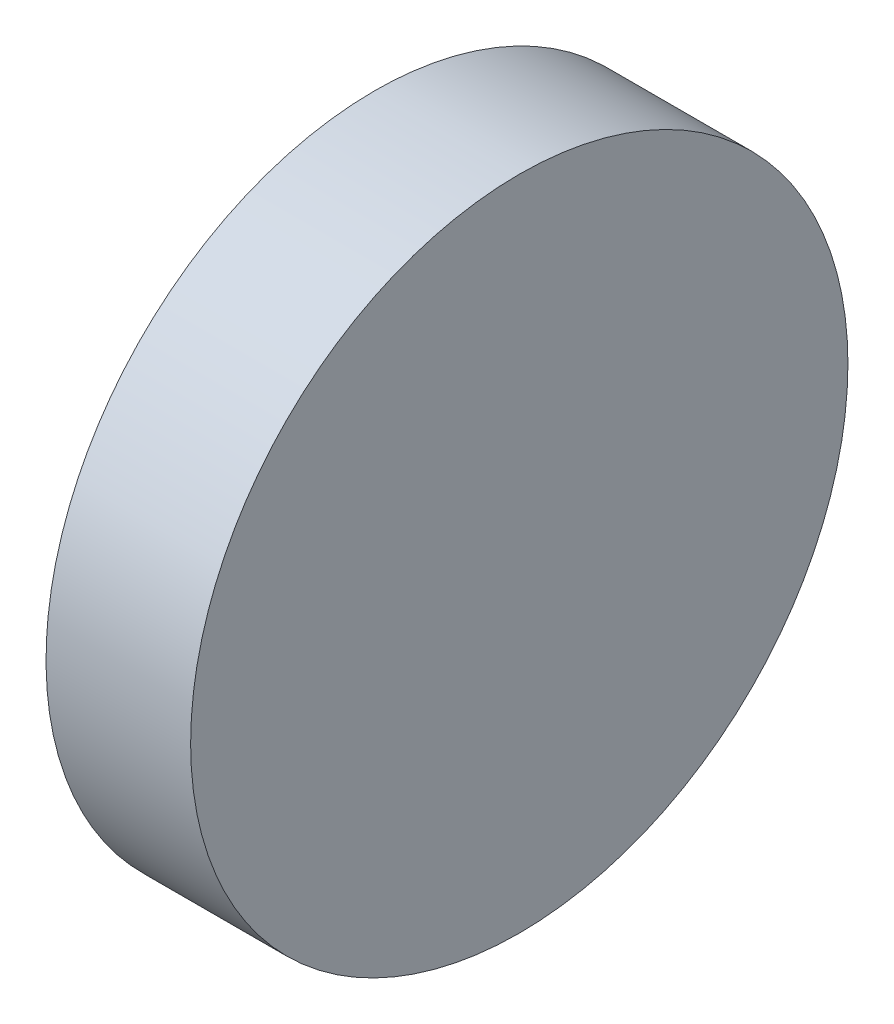
ISO-10303-21;
HEADER;
FILE_DESCRIPTION(('STEP AP214'),'2;1');
FILE_NAME('part.step','',(''),(''),'','','');
FILE_SCHEMA(('AUTOMOTIVE_DESIGN { 1 0 10303 214 1 1 1 1 }'));
ENDSEC;
DATA;
#1=APPLICATION_CONTEXT('core data for automotive mechanical design processes');
#2=APPLICATION_PROTOCOL_DEFINITION('international standard','automotive_design',2000,#1);
#3=PRODUCT_CONTEXT('',#1,'mechanical');
#4=PRODUCT('Part','Part','',(#3));
#5=PRODUCT_RELATED_PRODUCT_CATEGORY('part','',(#4));
#6=PRODUCT_DEFINITION_FORMATION('','',#4);
#7=PRODUCT_DEFINITION_CONTEXT('part definition',#1,'design');
#8=PRODUCT_DEFINITION('design','',#6,#7);
#9=PRODUCT_DEFINITION_SHAPE('','',#8);
#10=(LENGTH_UNIT() NAMED_UNIT(*) SI_UNIT(.MILLI.,.METRE.));
#11=(NAMED_UNIT(*) PLANE_ANGLE_UNIT() SI_UNIT($,.RADIAN.));
#12=(NAMED_UNIT(*) SI_UNIT($,.STERADIAN.) SOLID_ANGLE_UNIT());
#13=UNCERTAINTY_MEASURE_WITH_UNIT(LENGTH_MEASURE(1.E-05),#10,'distance_accuracy_value','');
#14=(GEOMETRIC_REPRESENTATION_CONTEXT(3) GLOBAL_UNCERTAINTY_ASSIGNED_CONTEXT((#13)) GLOBAL_UNIT_ASSIGNED_CONTEXT((#10,
#11,#12)) REPRESENTATION_CONTEXT('',''));
#15=CARTESIAN_POINT('',(0.,0.,0.));
#16=DIRECTION('',(0.,0.,1.));
#17=DIRECTION('',(1.,0.,0.));
#18=AXIS2_PLACEMENT_3D('',#15,#16,#17);
#19=CARTESIAN_POINT('',(171.379588267492,8.22627416998075,100.));
#20=CARTESIAN_POINT('',(171.379588267492,8.22627416998075,100.53840391905));
#21=CARTESIAN_POINT('',(171.379588267492,8.12021785486038,101.615211757149));
#22=CARTESIAN_POINT('',(171.379588267492,7.64907796388822,103.168351832291));
#23=CARTESIAN_POINT('',(171.379588267492,6.88398829641619,104.599733923351));
#24=CARTESIAN_POINT('',(171.379588267492,5.85435081929807,105.854350819297));
#25=CARTESIAN_POINT('',(171.379588267492,4.59973392335213,106.883988296415));
#26=CARTESIAN_POINT('',(171.379588267492,3.16835183229228,107.649077963887));
#27=CARTESIAN_POINT('',(171.379588267492,1.61521175714969,108.120217854859));
#28=CARTESIAN_POINT('',(171.379588267492,1.04746292572663E-12,108.27930232754));
#29=CARTESIAN_POINT('',(171.379588267492,-1.61521175714759,108.120217854859));
#30=CARTESIAN_POINT('',(171.379588267492,-3.16835183229019,107.649077963887));
#31=CARTESIAN_POINT('',(171.379588267492,-4.59973392335003,106.883988296415));
#32=CARTESIAN_POINT('',(171.379588267492,-5.85435081929598,105.854350819297));
#33=CARTESIAN_POINT('',(171.379588267492,-6.88398829641409,104.599733923351));
#34=CARTESIAN_POINT('',(171.379588267492,-7.64907796388613,103.168351832291));
#35=CARTESIAN_POINT('',(171.379588267492,-8.12021785485828,101.615211757149));
#36=CARTESIAN_POINT('',(171.379588267492,-8.27930232753885,100.));
#37=CARTESIAN_POINT('',(171.379588267492,-8.12021785485828,98.3847882428514));
#38=CARTESIAN_POINT('',(171.379588267492,-7.64907796388612,96.8316481677088));
#39=CARTESIAN_POINT('',(171.379588267492,-6.8839882964141,95.400266076649));
#40=CARTESIAN_POINT('',(171.379588267492,-5.85435081929598,94.145649180703));
#41=CARTESIAN_POINT('',(171.379588267492,-4.59973392335003,93.1160117035849));
#42=CARTESIAN_POINT('',(171.379588267492,-3.1683518322902,92.3509220361129));
#43=CARTESIAN_POINT('',(171.379588267492,-1.61521175714759,91.8797821451407));
#44=CARTESIAN_POINT('',(171.379588267492,1.04088424581843E-12,91.7206976724601));
#45=CARTESIAN_POINT('',(171.379588267492,1.61521175714969,91.8797821451407));
#46=CARTESIAN_POINT('',(171.379588267492,3.16835183229228,92.3509220361129));
#47=CARTESIAN_POINT('',(171.379588267492,4.59973392335213,93.1160117035849));
#48=CARTESIAN_POINT('',(171.379588267492,5.85435081929807,94.145649180703));
#49=CARTESIAN_POINT('',(171.379588267492,6.88398829641619,95.400266076649));
#50=CARTESIAN_POINT('',(171.379588267492,7.64907796388822,96.8316481677088));
#51=CARTESIAN_POINT('',(171.379588267492,8.12021785486037,98.3847882428514));
#52=CARTESIAN_POINT('',(171.379588267492,8.22627416998075,99.4615960809505));
#53=CARTESIAN_POINT('',(171.379588267492,8.22627416998075,100.));
#54=B_SPLINE_CURVE_WITH_KNOTS('',3,(#19,#20,#21,#22,#23,#24,#25,#26,#27,#28,#29,#30,#31,#32,#33,
#34,#35,#36,#37,#38,#39,#40,#41,#42,#43,#44,#45,#46,#47,#48,#49,#50,#51,#52,#53),.UNSPECIFIED.,
.T.,.F.,(4,1,1,1,1,1,1,1,1,1,1,1,1,1,1,1,1,1,1,1,1,1,1,1,1,1,1,1,1,1,1,1,4),(0.,
0.0312499999999999,0.0625000000000002,0.0937499999999997,0.125,0.15625,0.1875,0.21875,0.25,
0.28125,0.3125,0.34375,0.375,0.40625,0.4375,0.46875,0.5,0.53125,0.5625,0.59375,0.625,0.65625,
0.6875,0.71875,0.75,0.78125,0.8125,0.84375,0.875,0.90625,0.9375,0.96875,1.),.UNSPECIFIED.);
#55=DIRECTION('',(1.,0.,0.));
#56=VECTOR('',#55,1.);
#57=SURFACE_OF_LINEAR_EXTRUSION('',#54,#56);
#58=CARTESIAN_POINT('',(171.379588267492,8.22627416998075,100.));
#59=CARTESIAN_POINT('',(171.379588267492,8.22627416998075,100.53840391905));
#60=CARTESIAN_POINT('',(171.379588267492,8.12021785486038,101.615211757149));
#61=CARTESIAN_POINT('',(171.379588267492,7.64907796388822,103.168351832291));
#62=CARTESIAN_POINT('',(171.379588267492,6.88398829641619,104.599733923351));
#63=CARTESIAN_POINT('',(171.379588267492,5.85435081929807,105.854350819297));
#64=CARTESIAN_POINT('',(171.379588267492,4.59973392335213,106.883988296415));
#65=CARTESIAN_POINT('',(171.379588267492,3.16835183229228,107.649077963887));
#66=CARTESIAN_POINT('',(171.379588267492,1.61521175714969,108.120217854859));
#67=CARTESIAN_POINT('',(171.379588267492,1.04746292572663E-12,108.27930232754));
#68=CARTESIAN_POINT('',(171.379588267492,-1.61521175714759,108.120217854859));
#69=CARTESIAN_POINT('',(171.379588267492,-3.16835183229019,107.649077963887));
#70=CARTESIAN_POINT('',(171.379588267492,-4.59973392335003,106.883988296415));
#71=CARTESIAN_POINT('',(171.379588267492,-5.85435081929598,105.854350819297));
#72=CARTESIAN_POINT('',(171.379588267492,-6.88398829641409,104.599733923351));
#73=CARTESIAN_POINT('',(171.379588267492,-7.64907796388613,103.168351832291));
#74=CARTESIAN_POINT('',(171.379588267492,-8.12021785485828,101.615211757149));
#75=CARTESIAN_POINT('',(171.379588267492,-8.27930232753885,100.));
#76=CARTESIAN_POINT('',(171.379588267492,-8.12021785485828,98.3847882428514));
#77=CARTESIAN_POINT('',(171.379588267492,-7.64907796388612,96.8316481677088));
#78=CARTESIAN_POINT('',(171.379588267492,-6.8839882964141,95.400266076649));
#79=CARTESIAN_POINT('',(171.379588267492,-5.85435081929598,94.145649180703));
#80=CARTESIAN_POINT('',(171.379588267492,-4.59973392335003,93.1160117035849));
#81=CARTESIAN_POINT('',(171.379588267492,-3.1683518322902,92.3509220361129));
#82=CARTESIAN_POINT('',(171.379588267492,-1.61521175714759,91.8797821451407));
#83=CARTESIAN_POINT('',(171.379588267492,1.04088424581843E-12,91.7206976724601));
#84=CARTESIAN_POINT('',(171.379588267492,1.61521175714969,91.8797821451407));
#85=CARTESIAN_POINT('',(171.379588267492,3.16835183229228,92.3509220361129));
#86=CARTESIAN_POINT('',(171.379588267492,4.59973392335213,93.1160117035849));
#87=CARTESIAN_POINT('',(171.379588267492,5.85435081929807,94.145649180703));
#88=CARTESIAN_POINT('',(171.379588267492,6.88398829641619,95.400266076649));
#89=CARTESIAN_POINT('',(171.379588267492,7.64907796388822,96.8316481677088));
#90=CARTESIAN_POINT('',(171.379588267492,8.12021785486037,98.3847882428514));
#91=CARTESIAN_POINT('',(171.379588267492,8.22627416998075,99.4615960809505));
#92=CARTESIAN_POINT('',(171.379588267492,8.22627416998075,100.));
#93=B_SPLINE_CURVE_WITH_KNOTS('',3,(#58,#59,#60,#61,#62,#63,#64,#65,#66,#67,#68,#69,#70,#71,#72,
#73,#74,#75,#76,#77,#78,#79,#80,#81,#82,#83,#84,#85,#86,#87,#88,#89,#90,#91,#92),.UNSPECIFIED.,
.T.,.F.,(4,1,1,1,1,1,1,1,1,1,1,1,1,1,1,1,1,1,1,1,1,1,1,1,1,1,1,1,1,1,1,1,4),(0.,
0.0312499999999999,0.0625000000000002,0.0937499999999997,0.125,0.15625,0.1875,0.21875,0.25,
0.28125,0.3125,0.34375,0.375,0.40625,0.4375,0.46875,0.5,0.53125,0.5625,0.59375,0.625,0.65625,
0.6875,0.71875,0.75,0.78125,0.8125,0.84375,0.875,0.90625,0.9375,0.96875,1.),.UNSPECIFIED.);
#94=CARTESIAN_POINT('',(171.379588267492,8.22627416998075,100.));
#95=VERTEX_POINT('',#94);
#96=EDGE_CURVE('E9',#95,#95,#93,.T.);
#97=ORIENTED_EDGE('',*,*,#96,.T.);
#98=EDGE_LOOP('',(#97));
#99=FACE_BOUND('',#98,.T.);
#100=CARTESIAN_POINT('',(174.999,8.22627416998075,100.));
#101=CARTESIAN_POINT('',(174.999,8.22627414206144,99.8653981937389));
#102=CARTESIAN_POINT('',(174.999,8.22295987055275,99.7307973670926));
#103=CARTESIAN_POINT('',(174.999,8.20973470024489,99.4619190000391));
#104=CARTESIAN_POINT('',(174.999,8.19982375020405,99.3276414621512));
#105=CARTESIAN_POINT('',(174.999,8.17343708371173,99.0597331007838));
#106=CARTESIAN_POINT('',(174.999,8.15696136726026,98.9261022773044));
#107=CARTESIAN_POINT('',(174.999,8.11747680903498,98.6598099515152));
#108=CARTESIAN_POINT('',(174.999,8.09446801801037,98.527148441684));
#109=CARTESIAN_POINT('',(174.999,8.04194921894651,98.2631186046874));
#110=CARTESIAN_POINT('',(174.999,8.01243921090726,98.131750277522));
#111=CARTESIAN_POINT('',(174.999,7.94701251759827,97.87061814284));
#112=CARTESIAN_POINT('',(174.999,7.91109578256395,97.7408543477951));
#113=CARTESIAN_POINT('',(174.999,7.832949819735,97.4832416321854));
#114=CARTESIAN_POINT('',(174.999,7.79072059194036,97.3553927116206));
#115=CARTESIAN_POINT('',(174.999,7.7000436575477,97.1019201523597));
#116=CARTESIAN_POINT('',(174.999,7.6515959992563,96.9762964963858));
#117=CARTESIAN_POINT('',(174.999,7.54857666968685,96.7275858337261));
#118=CARTESIAN_POINT('',(174.999,7.49400499840878,96.6044988270405));
#119=CARTESIAN_POINT('',(174.999,7.37889110804194,96.361148386261));
#120=CARTESIAN_POINT('',(174.999,7.31834884257791,96.2408849741077));
#121=CARTESIAN_POINT('',(174.999,7.19144668497042,96.0034677360499));
#122=CARTESIAN_POINT('',(174.999,7.12508679282696,95.8863139101455));
#123=CARTESIAN_POINT('',(174.999,6.9867021470668,95.655401947258));
#124=CARTESIAN_POINT('',(174.999,6.91467743745777,95.5416437839049));
#125=CARTESIAN_POINT('',(174.999,6.76511655215924,95.3178101010976));
#126=CARTESIAN_POINT('',(174.999,6.68758037646974,95.2077345816434));
#127=CARTESIAN_POINT('',(174.999,6.52720305137158,94.9915176572796));
#128=CARTESIAN_POINT('',(174.999,6.44436186075917,94.8853762829365));
#129=CARTESIAN_POINT('',(174.999,6.273580287102,94.6772783333297));
#130=CARTESIAN_POINT('',(174.999,6.18563990405724,94.5753217580662));
#131=CARTESIAN_POINT('',(174.999,6.00486559126463,94.3758442089));
#132=CARTESIAN_POINT('',(174.999,5.91203169953432,94.2783232005485));
#133=CARTESIAN_POINT('',(174.999,5.72167679945255,94.0879683004668));
#134=CARTESIAN_POINT('',(174.999,5.62415579110109,93.9951344087365));
#135=CARTESIAN_POINT('',(174.999,5.42467824193491,93.8143600959438));
#136=CARTESIAN_POINT('',(174.999,5.32272166667134,93.7264197128991));
#137=CARTESIAN_POINT('',(174.999,5.11462371706462,93.5556381392419));
#138=CARTESIAN_POINT('',(174.999,5.00848234272146,93.4727969486295));
#139=CARTESIAN_POINT('',(174.999,4.79226541835763,93.3124196235313));
#140=CARTESIAN_POINT('',(174.999,4.68218989890337,93.2348834478418));
#141=CARTESIAN_POINT('',(174.999,4.45835621609625,93.0853225625433));
#142=CARTESIAN_POINT('',(174.999,4.34459805274338,93.0132978529343));
#143=CARTESIAN_POINT('',(174.999,4.11368608985532,92.8749132071741));
#144=CARTESIAN_POINT('',(174.999,3.99653226395006,92.8085533150306));
#145=CARTESIAN_POINT('',(174.999,3.75911502589449,92.6816511574232));
#146=CARTESIAN_POINT('',(174.999,3.63885161374418,92.6211088919593));
#147=CARTESIAN_POINT('',(174.999,3.39550117295659,92.5059950015921));
#148=CARTESIAN_POINT('',(174.999,3.27241416625995,92.4514233303135));
#149=CARTESIAN_POINT('',(174.999,3.02370350363037,92.3484040007455));
#150=CARTESIAN_POINT('',(174.999,2.89807984769743,92.2999563424562));
#151=CARTESIAN_POINT('',(174.999,2.64460728832436,92.209279408058));
#152=CARTESIAN_POINT('',(174.999,2.51675836760633,92.1670501802558));
#153=CARTESIAN_POINT('',(174.999,2.25914565241527,92.0889042174475));
#154=CARTESIAN_POINT('',(174.999,2.12938185794224,92.0529874824414));
#155=CARTESIAN_POINT('',(174.999,1.86824972169787,91.9875607890553));
#156=CARTESIAN_POINT('',(174.999,1.73688139239821,91.9580507809106));
#157=CARTESIAN_POINT('',(174.999,1.47285156123248,91.9055319821346));
#158=CARTESIAN_POINT('',(174.999,1.34019005936642,91.8825231915032));
#159=CARTESIAN_POINT('',(174.999,1.073897711816,91.8430386322037));
#160=CARTESIAN_POINT('',(174.999,0.940266858609888,91.8265629142848));
#161=CARTESIAN_POINT('',(174.999,0.672358578457259,91.8001762518015));
#162=CARTESIAN_POINT('',(174.999,0.538081151510737,91.7902653072372));
#163=CARTESIAN_POINT('',(174.999,0.269202481360858,91.7770401219673));
#164=CARTESIAN_POINT('',(174.999,0.134601240680952,91.7737258300203));
#165=CARTESIAN_POINT('',(174.999,-0.134601240678859,91.7737258300203));
#166=CARTESIAN_POINT('',(174.999,-0.269202481358765,91.7770401219673));
#167=CARTESIAN_POINT('',(174.999,-0.538081151508643,91.7902653072372));
#168=CARTESIAN_POINT('',(174.999,-0.672358578455164,91.8001762518015));
#169=CARTESIAN_POINT('',(174.999,-0.940266858607793,91.8265629142848));
#170=CARTESIAN_POINT('',(174.999,-1.0738977118139,91.8430386322037));
#171=CARTESIAN_POINT('',(174.999,-1.34019005936432,91.8825231915032));
#172=CARTESIAN_POINT('',(174.999,-1.47285156123039,91.9055319821346));
#173=CARTESIAN_POINT('',(174.999,-1.73688139239611,91.9580507809106));
#174=CARTESIAN_POINT('',(174.999,-1.86824972169578,91.9875607890552));
#175=CARTESIAN_POINT('',(174.999,-2.12938185794015,92.0529874824414));
#176=CARTESIAN_POINT('',(174.999,-2.25914565241318,92.0889042174474));
#177=CARTESIAN_POINT('',(174.999,-2.51675836760424,92.1670501802557));
#178=CARTESIAN_POINT('',(174.999,-2.64460728832227,92.209279408058));
#179=CARTESIAN_POINT('',(174.999,-2.89807984769534,92.2999563424562));
#180=CARTESIAN_POINT('',(174.999,-3.02370350362828,92.3484040007455));
#181=CARTESIAN_POINT('',(174.999,-3.27241416625785,92.4514233303135));
#182=CARTESIAN_POINT('',(174.999,-3.3955011729545,92.5059950015921));
#183=CARTESIAN_POINT('',(174.999,-3.63885161374208,92.6211088919594));
#184=CARTESIAN_POINT('',(174.999,-3.7591150258924,92.6816511574232));
#185=CARTESIAN_POINT('',(174.999,-3.99653226394797,92.8085533150306));
#186=CARTESIAN_POINT('',(174.999,-4.11368608985322,92.8749132071741));
#187=CARTESIAN_POINT('',(174.999,-4.34459805274128,93.0132978529343));
#188=CARTESIAN_POINT('',(174.999,-4.45835621609415,93.0853225625433));
#189=CARTESIAN_POINT('',(174.999,-4.68218989890128,93.2348834478418));
#190=CARTESIAN_POINT('',(174.999,-4.79226541835554,93.3124196235313));
#191=CARTESIAN_POINT('',(174.999,-5.00848234271936,93.4727969486295));
#192=CARTESIAN_POINT('',(174.999,-5.11462371706251,93.5556381392419));
#193=CARTESIAN_POINT('',(174.999,-5.32272166666924,93.726419712899));
#194=CARTESIAN_POINT('',(174.999,-5.42467824193281,93.8143600959438));
#195=CARTESIAN_POINT('',(174.999,-5.624155791099,93.9951344087364));
#196=CARTESIAN_POINT('',(174.999,-5.72167679945045,94.0879683004667));
#197=CARTESIAN_POINT('',(174.999,-5.91203169953222,94.2783232005485));
#198=CARTESIAN_POINT('',(174.999,-6.00486559126253,94.3758442089));
#199=CARTESIAN_POINT('',(174.999,-6.18563990405515,94.5753217580662));
#200=CARTESIAN_POINT('',(174.999,-6.27358028709991,94.6772783333297));
#201=CARTESIAN_POINT('',(174.999,-6.44436186075708,94.8853762829365));
#202=CARTESIAN_POINT('',(174.999,-6.52720305136949,94.9915176572796));
#203=CARTESIAN_POINT('',(174.999,-6.68758037646764,95.2077345816435));
#204=CARTESIAN_POINT('',(174.999,-6.76511655215715,95.3178101010977));
#205=CARTESIAN_POINT('',(174.999,-6.91467743745568,95.5416437839048));
#206=CARTESIAN_POINT('',(174.999,-6.98670214706469,95.6554019472577));
#207=CARTESIAN_POINT('',(174.999,-7.12508679282488,95.8863139101458));
#208=CARTESIAN_POINT('',(174.999,-7.19144668496838,96.003467736051));
#209=CARTESIAN_POINT('',(174.999,-7.31834884257576,96.2408849741066));
#210=CARTESIAN_POINT('',(174.999,-7.37889110803965,96.3611483862569));
#211=CARTESIAN_POINT('',(174.999,-7.49400499840688,96.6044988270445));
#212=CARTESIAN_POINT('',(174.999,-7.54857666968549,96.7275858337411));
#213=CARTESIAN_POINT('',(174.999,-7.65159599925347,96.9762964963707));
#214=CARTESIAN_POINT('',(174.999,-7.70004365754283,97.1019201523036));
#215=CARTESIAN_POINT('',(174.999,-7.79072059194102,97.3553927116767));
#216=CARTESIAN_POINT('',(174.999,-7.83294981974323,97.4832416323948));
#217=CARTESIAN_POINT('',(174.999,-7.91109578255152,97.7408543475858));
#218=CARTESIAN_POINT('',(174.999,-7.9470125175576,97.8706181420588));
#219=CARTESIAN_POINT('',(174.999,-8.01243921094372,98.1317502783032));
#220=CARTESIAN_POINT('',(174.999,-8.04194921908833,98.2631186076029));
#221=CARTESIAN_POINT('',(174.999,-8.09446801786436,98.5271484387686));
#222=CARTESIAN_POINT('',(174.999,-8.11747680849578,98.6598099406347));
#223=CARTESIAN_POINT('',(174.999,-8.15696136779527,98.9261022881851));
#224=CARTESIAN_POINT('',(174.999,-8.17343708571418,99.0597331413912));
#225=CARTESIAN_POINT('',(174.999,-8.19982374819742,99.3276414215438));
#226=CARTESIAN_POINT('',(174.999,-8.20973469276175,99.4619188484903));
#227=CARTESIAN_POINT('',(174.999,-8.22295987803164,99.7307975186402));
#228=CARTESIAN_POINT('',(174.999,-8.22627416997866,99.8653987593201));
#229=CARTESIAN_POINT('',(174.999,-8.22627416997866,100.13460124068));
#230=CARTESIAN_POINT('',(174.999,-8.22295987803164,100.26920248136));
#231=CARTESIAN_POINT('',(174.999,-8.20973469276175,100.53808115151));
#232=CARTESIAN_POINT('',(174.999,-8.19982374819742,100.672358578456));
#233=CARTESIAN_POINT('',(174.999,-8.17343708571418,100.940266858609));
#234=CARTESIAN_POINT('',(174.999,-8.15696136779527,101.073897711815));
#235=CARTESIAN_POINT('',(174.999,-8.11747680849578,101.340190059365));
#236=CARTESIAN_POINT('',(174.999,-8.09446801786436,101.472851561231));
#237=CARTESIAN_POINT('',(174.999,-8.04194921908833,101.736881392397));
#238=CARTESIAN_POINT('',(174.999,-8.01243921094373,101.868249721697));
#239=CARTESIAN_POINT('',(174.999,-7.94701251755761,102.129381857941));
#240=CARTESIAN_POINT('',(174.999,-7.91109578255152,102.259145652414));
#241=CARTESIAN_POINT('',(174.999,-7.83294981974323,102.516758367605));
#242=CARTESIAN_POINT('',(174.999,-7.79072059194103,102.644607288323));
#243=CARTESIAN_POINT('',(174.999,-7.70004365754283,102.898079847696));
#244=CARTESIAN_POINT('',(174.999,-7.65159599925346,103.023703503629));
#245=CARTESIAN_POINT('',(174.999,-7.54857666968549,103.272414166259));
#246=CARTESIAN_POINT('',(174.999,-7.49400499840689,103.395501172956));
#247=CARTESIAN_POINT('',(174.999,-7.37889110803965,103.638851613743));
#248=CARTESIAN_POINT('',(174.999,-7.31834884257576,103.759115025893));
#249=CARTESIAN_POINT('',(174.999,-7.19144668496838,103.996532263949));
#250=CARTESIAN_POINT('',(174.999,-7.12508679282488,104.113686089854));
#251=CARTESIAN_POINT('',(174.999,-6.98670214706469,104.344598052742));
#252=CARTESIAN_POINT('',(174.999,-6.91467743745567,104.458356216095));
#253=CARTESIAN_POINT('',(174.999,-6.76511655215715,104.682189898902));
#254=CARTESIAN_POINT('',(174.999,-6.68758037646764,104.792265418357));
#255=CARTESIAN_POINT('',(174.999,-6.52720305136948,105.00848234272));
#256=CARTESIAN_POINT('',(174.999,-6.44436186075708,105.114623717064));
#257=CARTESIAN_POINT('',(174.999,-6.27358028709991,105.32272166667));
#258=CARTESIAN_POINT('',(174.999,-6.18563990405515,105.424678241934));
#259=CARTESIAN_POINT('',(174.999,-6.00486559126253,105.6241557911));
#260=CARTESIAN_POINT('',(174.999,-5.91203169953222,105.721676799452));
#261=CARTESIAN_POINT('',(174.999,-5.72167679945045,105.912031699533));
#262=CARTESIAN_POINT('',(174.999,-5.624155791099,106.004865591264));
#263=CARTESIAN_POINT('',(174.999,-5.42467824193281,106.185639904056));
#264=CARTESIAN_POINT('',(174.999,-5.32272166666925,106.273580287101));
#265=CARTESIAN_POINT('',(174.999,-5.11462371706252,106.444361860758));
#266=CARTESIAN_POINT('',(174.999,-5.00848234271936,106.527203051371));
#267=CARTESIAN_POINT('',(174.999,-4.79226541835553,106.687580376469));
#268=CARTESIAN_POINT('',(174.999,-4.68218989890127,106.765116552158));
#269=CARTESIAN_POINT('',(174.999,-4.45835621609415,106.914677437457));
#270=CARTESIAN_POINT('',(174.999,-4.34459805274128,106.986702147066));
#271=CARTESIAN_POINT('',(174.999,-4.11368608985322,107.125086792826));
#272=CARTESIAN_POINT('',(174.999,-3.99653226394796,107.191446684969));
#273=CARTESIAN_POINT('',(174.999,-3.75911502589239,107.318348842577));
#274=CARTESIAN_POINT('',(174.999,-3.63885161374208,107.378891108041));
#275=CARTESIAN_POINT('',(174.999,-3.3955011729545,107.494004998408));
#276=CARTESIAN_POINT('',(174.999,-3.27241416625785,107.548576669687));
#277=CARTESIAN_POINT('',(174.999,-3.02370350362827,107.651595999255));
#278=CARTESIAN_POINT('',(174.999,-2.89807984769533,107.700043657544));
#279=CARTESIAN_POINT('',(174.999,-2.64460728832226,107.790720591942));
#280=CARTESIAN_POINT('',(174.999,-2.51675836760423,107.832949819744));
#281=CARTESIAN_POINT('',(174.999,-2.25914565241317,107.911095782553));
#282=CARTESIAN_POINT('',(174.999,-2.12938185794015,107.947012517559));
#283=CARTESIAN_POINT('',(174.999,-1.86824972169578,108.012439210945));
#284=CARTESIAN_POINT('',(174.999,-1.73688139239611,108.041949219089));
#285=CARTESIAN_POINT('',(174.999,-1.47285156123038,108.094468017865));
#286=CARTESIAN_POINT('',(174.999,-1.34019005936432,108.117476808497));
#287=CARTESIAN_POINT('',(174.999,-1.0738977118139,108.156961367796));
#288=CARTESIAN_POINT('',(174.999,-0.940266858607791,108.173437085715));
#289=CARTESIAN_POINT('',(174.999,-0.672358578455162,108.199823748198));
#290=CARTESIAN_POINT('',(174.999,-0.53808115150864,108.209734692763));
#291=CARTESIAN_POINT('',(174.999,-0.269202481358761,108.222959878033));
#292=CARTESIAN_POINT('',(174.999,-0.134601240678855,108.22627416998));
#293=CARTESIAN_POINT('',(174.999,0.134601240680957,108.22627416998));
#294=CARTESIAN_POINT('',(174.999,0.269202481360863,108.222959878033));
#295=CARTESIAN_POINT('',(174.999,0.538081151510741,108.209734692763));
#296=CARTESIAN_POINT('',(174.999,0.672358578457262,108.199823748198));
#297=CARTESIAN_POINT('',(174.999,0.940266858609892,108.173437085715));
#298=CARTESIAN_POINT('',(174.999,1.073897711816,108.156961367796));
#299=CARTESIAN_POINT('',(174.999,1.34019005936642,108.117476808497));
#300=CARTESIAN_POINT('',(174.999,1.47285156123248,108.094468017865));
#301=CARTESIAN_POINT('',(174.999,1.73688139239821,108.041949219089));
#302=CARTESIAN_POINT('',(174.999,1.86824972169788,108.012439210945));
#303=CARTESIAN_POINT('',(174.999,2.12938185794225,107.947012517559));
#304=CARTESIAN_POINT('',(174.999,2.25914565241527,107.911095782553));
#305=CARTESIAN_POINT('',(174.999,2.51675836760633,107.832949819744));
#306=CARTESIAN_POINT('',(174.999,2.64460728832436,107.790720591942));
#307=CARTESIAN_POINT('',(174.999,2.89807984769743,107.700043657544));
#308=CARTESIAN_POINT('',(174.999,3.02370350363037,107.651595999255));
#309=CARTESIAN_POINT('',(174.999,3.27241416625995,107.548576669687));
#310=CARTESIAN_POINT('',(174.999,3.39550117295659,107.494004998408));
#311=CARTESIAN_POINT('',(174.999,3.63885161374418,107.378891108041));
#312=CARTESIAN_POINT('',(174.999,3.75911502589449,107.318348842577));
#313=CARTESIAN_POINT('',(174.999,3.99653226395006,107.191446684969));
#314=CARTESIAN_POINT('',(174.999,4.11368608985532,107.125086792826));
#315=CARTESIAN_POINT('',(174.999,4.34459805274338,106.986702147066));
#316=CARTESIAN_POINT('',(174.999,4.45835621609625,106.914677437457));
#317=CARTESIAN_POINT('',(174.999,4.68218989890337,106.765116552158));
#318=CARTESIAN_POINT('',(174.999,4.79226541835764,106.687580376469));
#319=CARTESIAN_POINT('',(174.999,5.00848234272146,106.527203051371));
#320=CARTESIAN_POINT('',(174.999,5.11462371706462,106.444361860758));
#321=CARTESIAN_POINT('',(174.999,5.32272166667134,106.273580287101));
#322=CARTESIAN_POINT('',(174.999,5.42467824193491,106.185639904056));
#323=CARTESIAN_POINT('',(174.999,5.62415579110109,106.004865591264));
#324=CARTESIAN_POINT('',(174.999,5.72167679945255,105.912031699533));
#325=CARTESIAN_POINT('',(174.999,5.91203169953432,105.721676799452));
#326=CARTESIAN_POINT('',(174.999,6.00486559126463,105.6241557911));
#327=CARTESIAN_POINT('',(174.999,6.18563990405724,105.424678241934));
#328=CARTESIAN_POINT('',(174.999,6.27358028710201,105.32272166667));
#329=CARTESIAN_POINT('',(174.999,6.44436186075918,105.114623717064));
#330=CARTESIAN_POINT('',(174.999,6.52720305137158,105.00848234272));
#331=CARTESIAN_POINT('',(174.999,6.68758037646973,104.792265418357));
#332=CARTESIAN_POINT('',(174.999,6.76511655215924,104.682189898902));
#333=CARTESIAN_POINT('',(174.999,6.91467743745778,104.458356216095));
#334=CARTESIAN_POINT('',(174.999,6.98670214706681,104.344598052742));
#335=CARTESIAN_POINT('',(174.999,7.12508679282696,104.113686089855));
#336=CARTESIAN_POINT('',(174.999,7.19144668497042,103.99653226395));
#337=CARTESIAN_POINT('',(174.999,7.31834884257791,103.759115025892));
#338=CARTESIAN_POINT('',(174.999,7.37889110804194,103.638851613739));
#339=CARTESIAN_POINT('',(174.999,7.49400499840878,103.39550117296));
#340=CARTESIAN_POINT('',(174.999,7.54857666968684,103.272414166274));
#341=CARTESIAN_POINT('',(174.999,7.6515959992563,103.023703503614));
#342=CARTESIAN_POINT('',(174.999,7.7000436575477,102.89807984764));
#343=CARTESIAN_POINT('',(174.999,7.79072059194036,102.644607288379));
#344=CARTESIAN_POINT('',(174.999,7.832949819735,102.516758367815));
#345=CARTESIAN_POINT('',(174.999,7.91109578256395,102.259145652205));
#346=CARTESIAN_POINT('',(174.999,7.94701251759826,102.12938185716));
#347=CARTESIAN_POINT('',(174.999,8.01243921090726,101.868249722478));
#348=CARTESIAN_POINT('',(174.999,8.04194921894651,101.736881395313));
#349=CARTESIAN_POINT('',(174.999,8.09446801801037,101.472851558316));
#350=CARTESIAN_POINT('',(174.999,8.11747680903498,101.340190048485));
#351=CARTESIAN_POINT('',(174.999,8.15696136726026,101.073897722696));
#352=CARTESIAN_POINT('',(174.999,8.17343708371174,100.940266899216));
#353=CARTESIAN_POINT('',(174.999,8.19982375020405,100.672358537849));
#354=CARTESIAN_POINT('',(174.999,8.20973470024489,100.538080999961));
#355=CARTESIAN_POINT('',(174.999,8.22295987055275,100.269202632907));
#356=CARTESIAN_POINT('',(174.999,8.22627414206144,100.134601806261));
#357=CARTESIAN_POINT('',(174.999,8.22627416998075,100.));
#358=B_SPLINE_CURVE_WITH_KNOTS('',3,(#100,#101,#102,#103,#104,#105,#106,#107,#108,#109,#110,
#111,#112,#113,#114,#115,#116,#117,#118,#119,#120,#121,#122,#123,#124,#125,#126,#127,#128,#129,
#130,#131,#132,#133,#134,#135,#136,#137,#138,#139,#140,#141,#142,#143,#144,#145,#146,#147,#148,
#149,#150,#151,#152,#153,#154,#155,#156,#157,#158,#159,#160,#161,#162,#163,#164,#165,#166,#167,
#168,#169,#170,#171,#172,#173,#174,#175,#176,#177,#178,#179,#180,#181,#182,#183,#184,#185,#186,
#187,#188,#189,#190,#191,#192,#193,#194,#195,#196,#197,#198,#199,#200,#201,#202,#203,#204,#205,
#206,#207,#208,#209,#210,#211,#212,#213,#214,#215,#216,#217,#218,#219,#220,#221,#222,#223,#224,
#225,#226,#227,#228,#229,#230,#231,#232,#233,#234,#235,#236,#237,#238,#239,#240,#241,#242,#243,
#244,#245,#246,#247,#248,#249,#250,#251,#252,#253,#254,#255,#256,#257,#258,#259,#260,#261,#262,
#263,#264,#265,#266,#267,#268,#269,#270,#271,#272,#273,#274,#275,#276,#277,#278,#279,#280,#281,
#282,#283,#284,#285,#286,#287,#288,#289,#290,#291,#292,#293,#294,#295,#296,#297,#298,#299,#300,
#301,#302,#303,#304,#305,#306,#307,#308,#309,#310,#311,#312,#313,#314,#315,#316,#317,#318,#319,
#320,#321,#322,#323,#324,#325,#326,#327,#328,#329,#330,#331,#332,#333,#334,#335,#336,#337,#338,
#339,#340,#341,#342,#343,#344,#345,#346,#347,#348,#349,#350,#351,#352,#353,#354,#355,#356,#357),
.UNSPECIFIED.,.F.,.F.,(4,2,2,2,2,2,2,2,2,2,2,2,2,2,2,2,2,2,2,2,2,2,2,2,2,2,2,2,2,2,2,2,2,2,2,2,
2,2,2,2,2,2,2,2,2,2,2,2,2,2,2,2,2,2,2,2,2,2,2,2,2,2,2,2,2,2,2,2,2,2,2,2,2,2,2,2,2,2,2,2,2,2,2,2,
2,2,2,2,2,2,2,2,2,2,2,2,2,2,2,2,2,2,2,2,2,2,2,2,2,2,2,2,2,2,2,2,2,2,2,2,2,2,2,2,2,2,2,2,4),(0.,
0.403763342785356,0.807529821959094,1.21129630113285,1.61505964391818,2.01882298670352,
2.42258946587727,2.826355945051,3.23011928783634,3.63388263062168,4.03764910979545,
4.44141558896919,4.84517893175453,5.24894227453989,5.65270875371364,6.05647523288739,
6.46023857567272,6.86400191845806,7.26776839763182,7.67153487680556,8.0752982195909,
8.47906156237625,8.88282804155,9.28659452072374,9.69035786350909,10.0941212062944,
10.4978876854682,10.9016541646419,11.3054175074273,11.7091808502126,12.1129473293864,
12.5167138085601,12.9204771513455,13.3242404941308,13.7280069733045,14.1317734524783,
14.5355367952636,14.939300138049,15.3430666172227,15.7468330963965,16.1505964391818,
16.5543597819672,16.9581262611409,17.3618927403147,17.7656560831,18.1694194258854,
18.5731859050591,18.9769523842328,19.3807157270182,19.7844790698035,20.1882455489773,
20.592012028151,20.9957753709364,21.3995387137217,21.8033051928955,22.2070716720692,
22.6108350148546,23.0145983576399,23.4183648368137,23.8221313159874,24.2258946587728,
24.6296580015581,25.0334244807318,25.4371909599056,25.8409543026909,26.2447176454763,
26.64848412465,27.0522506038238,27.4560139466091,27.8597772893945,28.2635437685682,
28.667310247742,29.0710735905273,29.4748369333127,29.8786034124864,30.2823698916601,
30.6861332344455,31.0898965772308,31.4936630564046,31.8974295355783,32.3011928783637,
32.704956221149,33.1087227003228,33.5124891794965,33.9162525222819,34.3200158650672,
34.723782344241,35.1275488234147,35.5313121662,35.9350755089854,36.3388419881591,
36.7426084673329,37.1463718101182,37.5501351529036,37.9539016320773,38.3576681112511,
38.7614314540364,39.1651947968218,39.5689612759955,39.9727277551692,40.3764910979546,
40.7802544407399,41.1840209199137,41.5877873990874,41.9915507418728,42.3953140846581,
42.7990805638319,43.2028470430056,43.606610385791,44.0103737285763,44.41414020775,
44.8179066869238,45.2216700297091,45.6254333724945,46.0291998516682,46.432966330842,
46.8367296736273,47.2404930164127,47.6442594955864,48.0480259747601,48.4517893175455,
48.8555526603308,49.2593191395046,49.6630856186783,50.0668489614637,50.470612304249,
50.8743787834228,51.2781452625965,51.6819086053819),.UNSPECIFIED.);
#359=CARTESIAN_POINT('',(174.999,8.22627416998075,100.));
#360=VERTEX_POINT('',#359);
#361=EDGE_CURVE('E24',#360,#360,#358,.F.);
#362=ORIENTED_EDGE('',*,*,#361,.F.);
#363=EDGE_LOOP('',(#362));
#364=FACE_BOUND('',#363,.T.);
#365=ADVANCED_FACE('F14',(#99,#364),#57,.T.);
#366=CARTESIAN_POINT('',(171.379588267492,0.,-62.5));
#367=DIRECTION('',(1.,0.,0.));
#368=DIRECTION('',(0.,1.,0.));
#369=AXIS2_PLACEMENT_3D('',#366,#367,#368);
#370=PLANE('',#369);
#371=ORIENTED_EDGE('',*,*,#96,.F.);
#372=EDGE_LOOP('',(#371));
#373=FACE_BOUND('',#372,.T.);
#374=ADVANCED_FACE('F62',(#373),#370,.F.);
#375=CARTESIAN_POINT('',(174.999,0.,-62.5));
#376=DIRECTION('',(1.,0.,0.));
#377=DIRECTION('',(0.,1.,0.));
#378=AXIS2_PLACEMENT_3D('',#375,#376,#377);
#379=PLANE('',#378);
#380=ORIENTED_EDGE('',*,*,#361,.T.);
#381=EDGE_LOOP('',(#380));
#382=FACE_BOUND('',#381,.T.);
#383=ADVANCED_FACE('F31',(#382),#379,.T.);
#384=CLOSED_SHELL('',(#365,#374,#383));
#385=MANIFOLD_SOLID_BREP('B1',#384);
#386=ADVANCED_BREP_SHAPE_REPRESENTATION('',(#18,#385),#14);
#387=SHAPE_DEFINITION_REPRESENTATION(#9,#386);
ENDSEC;
END-ISO-10303-21;
